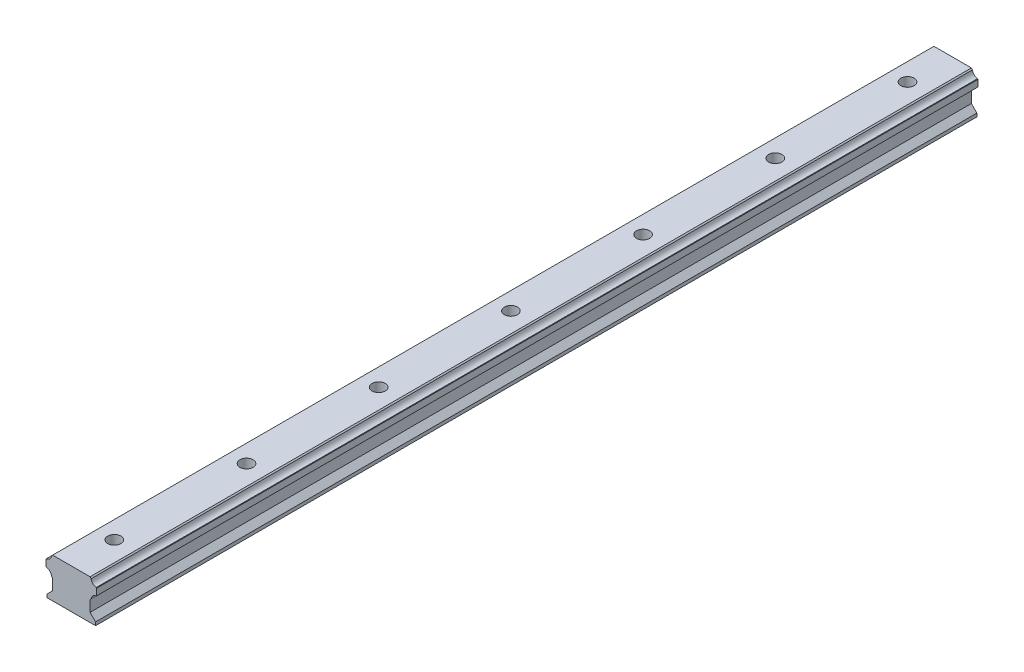
ISO-10303-21;
HEADER;
FILE_DESCRIPTION(('STEP AP214'),'2;1');
FILE_NAME('part.step','',(''),(''),'','','');
FILE_SCHEMA(('AUTOMOTIVE_DESIGN { 1 0 10303 214 1 1 1 1 }'));
ENDSEC;
DATA;
#1=APPLICATION_CONTEXT('core data for automotive mechanical design processes');
#2=APPLICATION_PROTOCOL_DEFINITION('international standard','automotive_design',2000,#1);
#3=PRODUCT_CONTEXT('',#1,'mechanical');
#4=PRODUCT('Part','Part','',(#3));
#5=PRODUCT_RELATED_PRODUCT_CATEGORY('part','',(#4));
#6=PRODUCT_DEFINITION_FORMATION('','',#4);
#7=PRODUCT_DEFINITION_CONTEXT('part definition',#1,'design');
#8=PRODUCT_DEFINITION('design','',#6,#7);
#9=PRODUCT_DEFINITION_SHAPE('','',#8);
#10=(LENGTH_UNIT() NAMED_UNIT(*) SI_UNIT(.MILLI.,.METRE.));
#11=(NAMED_UNIT(*) PLANE_ANGLE_UNIT() SI_UNIT($,.RADIAN.));
#12=(NAMED_UNIT(*) SI_UNIT($,.STERADIAN.) SOLID_ANGLE_UNIT());
#13=UNCERTAINTY_MEASURE_WITH_UNIT(LENGTH_MEASURE(1.E-05),#10,'distance_accuracy_value','');
#14=(GEOMETRIC_REPRESENTATION_CONTEXT(3) GLOBAL_UNCERTAINTY_ASSIGNED_CONTEXT((#13)) GLOBAL_UNIT_ASSIGNED_CONTEXT((#10,
#11,#12)) REPRESENTATION_CONTEXT('',''));
#15=CARTESIAN_POINT('',(0.,0.,0.));
#16=DIRECTION('',(0.,0.,1.));
#17=DIRECTION('',(1.,0.,0.));
#18=AXIS2_PLACEMENT_3D('',#15,#16,#17);
#19=CARTESIAN_POINT('',(-10.0012116020146,-16.2762221715419,400.));
#20=DIRECTION('',(1.,0.,0.));
#21=DIRECTION('',(0.,0.,-1.));
#22=AXIS2_PLACEMENT_3D('',#19,#20,#21);
#23=PLANE('',#22);
#24=DIRECTION('',(0.,-1.,0.));
#25=VECTOR('',#24,1.);
#26=CARTESIAN_POINT('',(-10.0012116020146,-16.2762221715419,0.));
#27=LINE('',#26,#25);
#28=CARTESIAN_POINT('',(-10.0012116020146,-16.2762221715419,0.));
#29=VERTEX_POINT('',#28);
#30=CARTESIAN_POINT('',(-10.0012116020146,-17.7762221715421,0.));
#31=VERTEX_POINT('',#30);
#32=EDGE_CURVE('E214',#29,#31,#27,.T.);
#33=ORIENTED_EDGE('',*,*,#32,.T.);
#34=DIRECTION('',(0.,0.,-1.));
#35=VECTOR('',#34,1.);
#36=CARTESIAN_POINT('',(-10.0012116020146,-17.7762221715421,400.));
#37=LINE('',#36,#35);
#38=CARTESIAN_POINT('',(-10.0012116020146,-17.7762221715421,400.));
#39=VERTEX_POINT('',#38);
#40=EDGE_CURVE('E312',#39,#31,#37,.T.);
#41=ORIENTED_EDGE('',*,*,#40,.F.);
#42=DIRECTION('',(0.,-1.,0.));
#43=VECTOR('',#42,1.);
#44=CARTESIAN_POINT('',(-10.0012116020146,-16.2762221715419,400.));
#45=LINE('',#44,#43);
#46=CARTESIAN_POINT('',(-10.0012116020146,-16.2762221715419,400.));
#47=VERTEX_POINT('',#46);
#48=EDGE_CURVE('E257',#47,#39,#45,.T.);
#49=ORIENTED_EDGE('',*,*,#48,.F.);
#50=DIRECTION('',(0.,0.,-1.));
#51=VECTOR('',#50,1.);
#52=CARTESIAN_POINT('',(-10.0012116020146,-16.2762221715419,400.));
#53=LINE('',#52,#51);
#54=EDGE_CURVE('E210',#47,#29,#53,.T.);
#55=ORIENTED_EDGE('',*,*,#54,.T.);
#56=EDGE_LOOP('',(#33,#41,#49,#55));
#57=FACE_BOUND('',#56,.T.);
#58=ADVANCED_FACE('F32',(#57),#23,.F.);
#59=CARTESIAN_POINT('',(-10.0012116020146,-17.7762221715421,400.));
#60=DIRECTION('',(0.,1.,0.));
#61=DIRECTION('',(0.,0.,1.));
#62=AXIS2_PLACEMENT_3D('',#59,#60,#61);
#63=PLANE('',#62);
#64=CARTESIAN_POINT('',(0.499394198992774,-17.7762221715421,20.0000000000001));
#65=DIRECTION('',(0.,1.,0.));
#66=DIRECTION('',(0.,0.,1.));
#67=AXIS2_PLACEMENT_3D('',#64,#65,#66);
#68=CIRCLE('',#67,3.);
#69=CARTESIAN_POINT('',(0.499394198992774,-17.7762221715421,23.0000000000001));
#70=VERTEX_POINT('',#69);
#71=EDGE_CURVE('E487',#70,#70,#68,.T.);
#72=ORIENTED_EDGE('',*,*,#71,.T.);
#73=EDGE_LOOP('',(#72));
#74=FACE_BOUND('',#73,.T.);
#75=CARTESIAN_POINT('',(0.499394198992774,-17.7762221715421,80.0000000000001));
#76=DIRECTION('',(0.,1.,0.));
#77=DIRECTION('',(0.,0.,1.));
#78=AXIS2_PLACEMENT_3D('',#75,#76,#77);
#79=CIRCLE('',#78,3.);
#80=CARTESIAN_POINT('',(0.499394198992774,-17.7762221715421,83.0000000000001));
#81=VERTEX_POINT('',#80);
#82=EDGE_CURVE('E481',#81,#81,#79,.T.);
#83=ORIENTED_EDGE('',*,*,#82,.T.);
#84=EDGE_LOOP('',(#83));
#85=FACE_BOUND('',#84,.T.);
#86=CARTESIAN_POINT('',(0.499394198992774,-17.7762221715421,140.));
#87=DIRECTION('',(0.,1.,0.));
#88=DIRECTION('',(0.,0.,1.));
#89=AXIS2_PLACEMENT_3D('',#86,#87,#88);
#90=CIRCLE('',#89,3.);
#91=CARTESIAN_POINT('',(0.499394198992774,-17.7762221715421,143.));
#92=VERTEX_POINT('',#91);
#93=EDGE_CURVE('E477',#92,#92,#90,.T.);
#94=ORIENTED_EDGE('',*,*,#93,.T.);
#95=EDGE_LOOP('',(#94));
#96=FACE_BOUND('',#95,.T.);
#97=CARTESIAN_POINT('',(0.499394198992774,-17.7762221715421,260.));
#98=DIRECTION('',(0.,1.,0.));
#99=DIRECTION('',(0.,0.,1.));
#100=AXIS2_PLACEMENT_3D('',#97,#98,#99);
#101=CIRCLE('',#100,3.);
#102=CARTESIAN_POINT('',(0.499394198992774,-17.7762221715421,263.));
#103=VERTEX_POINT('',#102);
#104=EDGE_CURVE('E474',#103,#103,#101,.T.);
#105=ORIENTED_EDGE('',*,*,#104,.T.);
#106=EDGE_LOOP('',(#105));
#107=FACE_BOUND('',#106,.T.);
#108=CARTESIAN_POINT('',(0.499394198992774,-17.7762221715421,200.));
#109=DIRECTION('',(0.,1.,0.));
#110=DIRECTION('',(0.,0.,1.));
#111=AXIS2_PLACEMENT_3D('',#108,#109,#110);
#112=CIRCLE('',#111,3.);
#113=CARTESIAN_POINT('',(0.499394198992774,-17.7762221715421,203.));
#114=VERTEX_POINT('',#113);
#115=EDGE_CURVE('E218',#114,#114,#112,.T.);
#116=ORIENTED_EDGE('',*,*,#115,.T.);
#117=EDGE_LOOP('',(#116));
#118=FACE_BOUND('',#117,.T.);
#119=DIRECTION('',(1.,0.,0.));
#120=VECTOR('',#119,1.);
#121=CARTESIAN_POINT('',(-10.0012116020146,-17.7762221715421,0.));
#122=LINE('',#121,#120);
#123=CARTESIAN_POINT('',(11.9987883979856,-17.7762221715421,0.));
#124=VERTEX_POINT('',#123);
#125=EDGE_CURVE('E217',#31,#124,#122,.T.);
#126=ORIENTED_EDGE('',*,*,#125,.T.);
#127=DIRECTION('',(0.,0.,-1.));
#128=VECTOR('',#127,1.);
#129=CARTESIAN_POINT('',(11.9987883979856,-17.7762221715421,400.));
#130=LINE('',#129,#128);
#131=CARTESIAN_POINT('',(11.9987883979856,-17.7762221715421,400.));
#132=VERTEX_POINT('',#131);
#133=EDGE_CURVE('E309',#132,#124,#130,.T.);
#134=ORIENTED_EDGE('',*,*,#133,.F.);
#135=DIRECTION('',(1.,0.,0.));
#136=VECTOR('',#135,1.);
#137=CARTESIAN_POINT('',(-10.0012116020146,-17.7762221715421,400.));
#138=LINE('',#137,#136);
#139=EDGE_CURVE('E135',#39,#132,#138,.T.);
#140=ORIENTED_EDGE('',*,*,#139,.F.);
#141=ORIENTED_EDGE('',*,*,#40,.T.);
#142=EDGE_LOOP('',(#126,#134,#140,#141));
#143=FACE_BOUND('',#142,.T.);
#144=CARTESIAN_POINT('',(0.499394198992774,-17.7762221715421,320.));
#145=DIRECTION('',(0.,1.,0.));
#146=DIRECTION('',(0.,0.,1.));
#147=AXIS2_PLACEMENT_3D('',#144,#145,#146);
#148=CIRCLE('',#147,3.);
#149=CARTESIAN_POINT('',(0.499394198992774,-17.7762221715421,323.));
#150=VERTEX_POINT('',#149);
#151=EDGE_CURVE('E314',#150,#150,#148,.T.);
#152=ORIENTED_EDGE('',*,*,#151,.T.);
#153=EDGE_LOOP('',(#152));
#154=FACE_BOUND('',#153,.T.);
#155=CARTESIAN_POINT('',(0.499394198992774,-17.7762221715421,380.));
#156=DIRECTION('',(0.,1.,0.));
#157=DIRECTION('',(0.,0.,1.));
#158=AXIS2_PLACEMENT_3D('',#155,#156,#157);
#159=CIRCLE('',#158,3.);
#160=CARTESIAN_POINT('',(0.499394198992774,-17.7762221715421,383.));
#161=VERTEX_POINT('',#160);
#162=EDGE_CURVE('E41',#161,#161,#159,.T.);
#163=ORIENTED_EDGE('',*,*,#162,.T.);
#164=EDGE_LOOP('',(#163));
#165=FACE_BOUND('',#164,.T.);
#166=ADVANCED_FACE('F322',(#74,#85,#96,#107,#118,#143,#154,#165),#63,.F.);
#167=CARTESIAN_POINT('',(11.9987883979856,-17.7762221715421,400.));
#168=DIRECTION('',(-1.,0.,0.));
#169=DIRECTION('',(0.,0.,1.));
#170=AXIS2_PLACEMENT_3D('',#167,#168,#169);
#171=PLANE('',#170);
#172=DIRECTION('',(0.,1.,0.));
#173=VECTOR('',#172,1.);
#174=CARTESIAN_POINT('',(11.9987883979856,-17.7762221715421,0.));
#175=LINE('',#174,#173);
#176=CARTESIAN_POINT('',(11.9987883979856,-16.2762221715418,0.));
#177=VERTEX_POINT('',#176);
#178=EDGE_CURVE('E220',#124,#177,#175,.T.);
#179=ORIENTED_EDGE('',*,*,#178,.T.);
#180=DIRECTION('',(0.,0.,-1.));
#181=VECTOR('',#180,1.);
#182=CARTESIAN_POINT('',(11.9987883979856,-16.2762221715418,400.));
#183=LINE('',#182,#181);
#184=CARTESIAN_POINT('',(11.9987883979856,-16.2762221715418,400.));
#185=VERTEX_POINT('',#184);
#186=EDGE_CURVE('E306',#185,#177,#183,.T.);
#187=ORIENTED_EDGE('',*,*,#186,.F.);
#188=DIRECTION('',(0.,1.,0.));
#189=VECTOR('',#188,1.);
#190=CARTESIAN_POINT('',(11.9987883979856,-17.7762221715421,400.));
#191=LINE('',#190,#189);
#192=EDGE_CURVE('E462',#132,#185,#191,.T.);
#193=ORIENTED_EDGE('',*,*,#192,.F.);
#194=ORIENTED_EDGE('',*,*,#133,.T.);
#195=EDGE_LOOP('',(#179,#187,#193,#194));
#196=FACE_BOUND('',#195,.T.);
#197=ADVANCED_FACE('F354',(#196),#171,.F.);
#198=CARTESIAN_POINT('',(9.49878839798558,-13.7762221715417,400.));
#199=DIRECTION('',(-0.707106781186548,-0.707106781186548,0.));
#200=DIRECTION('',(0.707106781186548,-0.707106781186548,0.));
#201=AXIS2_PLACEMENT_3D('',#198,#199,#200);
#202=PLANE('',#201);
#203=DIRECTION('',(-0.707106781186548,0.707106781186548,0.));
#204=VECTOR('',#203,1.);
#205=CARTESIAN_POINT('',(9.49878839798558,-13.7762221715417,0.));
#206=LINE('',#205,#204);
#207=CARTESIAN_POINT('',(9.49878839798558,-13.7762221715417,0.));
#208=VERTEX_POINT('',#207);
#209=EDGE_CURVE('E222',#177,#208,#206,.T.);
#210=ORIENTED_EDGE('',*,*,#209,.T.);
#211=DIRECTION('',(0.,0.,-1.));
#212=VECTOR('',#211,1.);
#213=CARTESIAN_POINT('',(9.49878839798558,-13.7762221715417,400.));
#214=LINE('',#213,#212);
#215=CARTESIAN_POINT('',(9.49878839798558,-13.7762221715417,400.));
#216=VERTEX_POINT('',#215);
#217=EDGE_CURVE('E303',#216,#208,#214,.T.);
#218=ORIENTED_EDGE('',*,*,#217,.F.);
#219=DIRECTION('',(-0.707106781186548,0.707106781186548,0.));
#220=VECTOR('',#219,1.);
#221=CARTESIAN_POINT('',(9.49878839798558,-13.7762221715417,400.));
#222=LINE('',#221,#220);
#223=EDGE_CURVE('E460',#185,#216,#222,.T.);
#224=ORIENTED_EDGE('',*,*,#223,.F.);
#225=ORIENTED_EDGE('',*,*,#186,.T.);
#226=EDGE_LOOP('',(#210,#218,#224,#225));
#227=FACE_BOUND('',#226,.T.);
#228=ADVANCED_FACE('F566',(#227),#202,.F.);
#229=CARTESIAN_POINT('',(9.49878839798558,-8.77622217154181,400.));
#230=DIRECTION('',(-1.,0.,0.));
#231=DIRECTION('',(0.,0.,1.));
#232=AXIS2_PLACEMENT_3D('',#229,#230,#231);
#233=PLANE('',#232);
#234=DIRECTION('',(0.,1.,0.));
#235=VECTOR('',#234,1.);
#236=CARTESIAN_POINT('',(9.49878839798558,-8.77622217154181,0.));
#237=LINE('',#236,#235);
#238=CARTESIAN_POINT('',(9.49878839798558,-8.77622217154181,0.));
#239=VERTEX_POINT('',#238);
#240=EDGE_CURVE('E224',#208,#239,#237,.T.);
#241=ORIENTED_EDGE('',*,*,#240,.T.);
#242=DIRECTION('',(0.,0.,-1.));
#243=VECTOR('',#242,1.);
#244=CARTESIAN_POINT('',(9.49878839798558,-8.77622217154181,400.));
#245=LINE('',#244,#243);
#246=CARTESIAN_POINT('',(9.49878839798558,-8.77622217154181,400.));
#247=VERTEX_POINT('',#246);
#248=EDGE_CURVE('E300',#247,#239,#245,.T.);
#249=ORIENTED_EDGE('',*,*,#248,.F.);
#250=DIRECTION('',(0.,1.,0.));
#251=VECTOR('',#250,1.);
#252=CARTESIAN_POINT('',(9.49878839798558,-8.77622217154181,400.));
#253=LINE('',#252,#251);
#254=EDGE_CURVE('E458',#216,#247,#253,.T.);
#255=ORIENTED_EDGE('',*,*,#254,.F.);
#256=ORIENTED_EDGE('',*,*,#217,.T.);
#257=EDGE_LOOP('',(#241,#249,#255,#256));
#258=FACE_BOUND('',#257,.T.);
#259=ADVANCED_FACE('F561',(#258),#233,.F.);
#260=CARTESIAN_POINT('',(10.0063729844235,-8.26863758510385,400.));
#261=DIRECTION('',(-0.707106781186548,0.707106781186548,0.));
#262=DIRECTION('',(-0.707106781186548,-0.707106781186548,0.));
#263=AXIS2_PLACEMENT_3D('',#260,#261,#262);
#264=PLANE('',#263);
#265=DIRECTION('',(0.707106781186548,0.707106781186548,0.));
#266=VECTOR('',#265,1.);
#267=CARTESIAN_POINT('',(10.0063729844235,-8.26863758510385,0.));
#268=LINE('',#267,#266);
#269=CARTESIAN_POINT('',(10.0063729844235,-8.26863758510385,0.));
#270=VERTEX_POINT('',#269);
#271=EDGE_CURVE('E226',#239,#270,#268,.T.);
#272=ORIENTED_EDGE('',*,*,#271,.T.);
#273=DIRECTION('',(0.,0.,-1.));
#274=VECTOR('',#273,1.);
#275=CARTESIAN_POINT('',(10.0063729844235,-8.26863758510385,400.));
#276=LINE('',#275,#274);
#277=CARTESIAN_POINT('',(10.0063729844235,-8.26863758510385,400.));
#278=VERTEX_POINT('',#277);
#279=EDGE_CURVE('E297',#278,#270,#276,.T.);
#280=ORIENTED_EDGE('',*,*,#279,.F.);
#281=DIRECTION('',(0.707106781186548,0.707106781186548,0.));
#282=VECTOR('',#281,1.);
#283=CARTESIAN_POINT('',(10.0063729844235,-8.26863758510385,400.));
#284=LINE('',#283,#282);
#285=EDGE_CURVE('E456',#247,#278,#284,.T.);
#286=ORIENTED_EDGE('',*,*,#285,.F.);
#287=ORIENTED_EDGE('',*,*,#248,.T.);
#288=EDGE_LOOP('',(#272,#280,#286,#287));
#289=FACE_BOUND('',#288,.T.);
#290=ADVANCED_FACE('F555',(#289),#264,.F.);
#291=CARTESIAN_POINT('',(12.4987883979856,-8.46322794005069,400.));
#292=DIRECTION('',(0.,0.,-1.));
#293=DIRECTION('',(-1.,0.,0.));
#294=AXIS2_PLACEMENT_3D('',#291,#292,#293);
#295=CYLINDRICAL_SURFACE('',#294,2.5);
#296=CARTESIAN_POINT('',(12.4987883979856,-8.46322794005069,0.));
#297=DIRECTION('',(0.,0.,-1.));
#298=DIRECTION('',(1.,0.,0.));
#299=AXIS2_PLACEMENT_3D('',#296,#297,#298);
#300=CIRCLE('',#299,2.5);
#301=CARTESIAN_POINT('',(12.3041980430387,-5.97081252648865,0.));
#302=VERTEX_POINT('',#301);
#303=EDGE_CURVE('E228',#270,#302,#300,.T.);
#304=ORIENTED_EDGE('',*,*,#303,.T.);
#305=DIRECTION('',(0.,0.,-1.));
#306=VECTOR('',#305,1.);
#307=CARTESIAN_POINT('',(12.3041980430387,-5.97081252648865,400.));
#308=LINE('',#307,#306);
#309=CARTESIAN_POINT('',(12.3041980430387,-5.97081252648865,400.));
#310=VERTEX_POINT('',#309);
#311=EDGE_CURVE('E294',#310,#302,#308,.T.);
#312=ORIENTED_EDGE('',*,*,#311,.F.);
#313=CARTESIAN_POINT('',(12.4987883979856,-8.46322794005069,400.));
#314=DIRECTION('',(0.,0.,-1.));
#315=DIRECTION('',(1.,0.,0.));
#316=AXIS2_PLACEMENT_3D('',#313,#314,#315);
#317=CIRCLE('',#316,2.5);
#318=EDGE_CURVE('E454',#278,#310,#317,.T.);
#319=ORIENTED_EDGE('',*,*,#318,.F.);
#320=ORIENTED_EDGE('',*,*,#279,.T.);
#321=EDGE_LOOP('',(#304,#312,#319,#320));
#322=FACE_BOUND('',#321,.T.);
#323=ADVANCED_FACE('F551',(#322),#295,.F.);
#324=CARTESIAN_POINT('',(12.4987883979856,-5.77622217154175,400.));
#325=DIRECTION('',(-0.707106781186547,0.707106781186547,0.));
#326=DIRECTION('',(-0.707106781186548,-0.707106781186548,0.));
#327=AXIS2_PLACEMENT_3D('',#324,#325,#326);
#328=PLANE('',#327);
#329=DIRECTION('',(0.707106781186547,0.707106781186547,0.));
#330=VECTOR('',#329,1.);
#331=CARTESIAN_POINT('',(12.4987883979856,-5.77622217154175,0.));
#332=LINE('',#331,#330);
#333=CARTESIAN_POINT('',(12.4987883979856,-5.77622217154175,0.));
#334=VERTEX_POINT('',#333);
#335=EDGE_CURVE('E230',#302,#334,#332,.T.);
#336=ORIENTED_EDGE('',*,*,#335,.T.);
#337=DIRECTION('',(0.,0.,-1.));
#338=VECTOR('',#337,1.);
#339=CARTESIAN_POINT('',(12.4987883979856,-5.77622217154175,400.));
#340=LINE('',#339,#338);
#341=CARTESIAN_POINT('',(12.4987883979856,-5.77622217154175,400.));
#342=VERTEX_POINT('',#341);
#343=EDGE_CURVE('E291',#342,#334,#340,.T.);
#344=ORIENTED_EDGE('',*,*,#343,.F.);
#345=DIRECTION('',(0.707106781186547,0.707106781186547,0.));
#346=VECTOR('',#345,1.);
#347=CARTESIAN_POINT('',(12.4987883979856,-5.77622217154175,400.));
#348=LINE('',#347,#346);
#349=EDGE_CURVE('E452',#310,#342,#348,.T.);
#350=ORIENTED_EDGE('',*,*,#349,.F.);
#351=ORIENTED_EDGE('',*,*,#311,.T.);
#352=EDGE_LOOP('',(#336,#344,#350,#351));
#353=FACE_BOUND('',#352,.T.);
#354=ADVANCED_FACE('F546',(#353),#328,.F.);
#355=CARTESIAN_POINT('',(12.4987883979856,-2.77622217154181,400.));
#356=DIRECTION('',(-1.,0.,0.));
#357=DIRECTION('',(0.,0.,1.));
#358=AXIS2_PLACEMENT_3D('',#355,#356,#357);
#359=PLANE('',#358);
#360=DIRECTION('',(0.,1.,0.));
#361=VECTOR('',#360,1.);
#362=CARTESIAN_POINT('',(12.4987883979856,-2.77622217154181,0.));
#363=LINE('',#362,#361);
#364=CARTESIAN_POINT('',(12.4987883979856,-2.77622217154181,0.));
#365=VERTEX_POINT('',#364);
#366=EDGE_CURVE('E232',#334,#365,#363,.T.);
#367=ORIENTED_EDGE('',*,*,#366,.T.);
#368=DIRECTION('',(0.,0.,-1.));
#369=VECTOR('',#368,1.);
#370=CARTESIAN_POINT('',(12.4987883979856,-2.77622217154181,400.));
#371=LINE('',#370,#369);
#372=CARTESIAN_POINT('',(12.4987883979856,-2.77622217154181,400.));
#373=VERTEX_POINT('',#372);
#374=EDGE_CURVE('E288',#373,#365,#371,.T.);
#375=ORIENTED_EDGE('',*,*,#374,.F.);
#376=DIRECTION('',(0.,1.,0.));
#377=VECTOR('',#376,1.);
#378=CARTESIAN_POINT('',(12.4987883979856,-2.77622217154181,400.));
#379=LINE('',#378,#377);
#380=EDGE_CURVE('E450',#342,#373,#379,.T.);
#381=ORIENTED_EDGE('',*,*,#380,.F.);
#382=ORIENTED_EDGE('',*,*,#343,.T.);
#383=EDGE_LOOP('',(#367,#375,#381,#382));
#384=FACE_BOUND('',#383,.T.);
#385=ADVANCED_FACE('F540',(#384),#359,.F.);
#386=CARTESIAN_POINT('',(12.3041980430388,-2.58163181659496,400.));
#387=DIRECTION('',(-0.707106781186547,-0.707106781186547,0.));
#388=DIRECTION('',(0.707106781186548,-0.707106781186548,0.));
#389=AXIS2_PLACEMENT_3D('',#386,#387,#388);
#390=PLANE('',#389);
#391=DIRECTION('',(-0.707106781186547,0.707106781186547,0.));
#392=VECTOR('',#391,1.);
#393=CARTESIAN_POINT('',(12.3041980430388,-2.58163181659496,0.));
#394=LINE('',#393,#392);
#395=CARTESIAN_POINT('',(12.3041980430388,-2.58163181659496,0.));
#396=VERTEX_POINT('',#395);
#397=EDGE_CURVE('E234',#365,#396,#394,.T.);
#398=ORIENTED_EDGE('',*,*,#397,.T.);
#399=DIRECTION('',(0.,0.,-1.));
#400=VECTOR('',#399,1.);
#401=CARTESIAN_POINT('',(12.3041980430388,-2.58163181659496,400.));
#402=LINE('',#401,#400);
#403=CARTESIAN_POINT('',(12.3041980430388,-2.58163181659496,400.));
#404=VERTEX_POINT('',#403);
#405=EDGE_CURVE('E285',#404,#396,#402,.T.);
#406=ORIENTED_EDGE('',*,*,#405,.F.);
#407=DIRECTION('',(-0.707106781186547,0.707106781186547,0.));
#408=VECTOR('',#407,1.);
#409=CARTESIAN_POINT('',(12.3041980430388,-2.58163181659496,400.));
#410=LINE('',#409,#408);
#411=EDGE_CURVE('E448',#373,#404,#410,.T.);
#412=ORIENTED_EDGE('',*,*,#411,.F.);
#413=ORIENTED_EDGE('',*,*,#374,.T.);
#414=EDGE_LOOP('',(#398,#406,#412,#413));
#415=FACE_BOUND('',#414,.T.);
#416=ADVANCED_FACE('F536',(#415),#390,.F.);
#417=CARTESIAN_POINT('',(12.4987883979856,-0.0892164030329295,400.));
#418=DIRECTION('',(0.,0.,-1.));
#419=DIRECTION('',(-1.,0.,0.));
#420=AXIS2_PLACEMENT_3D('',#417,#418,#419);
#421=CYLINDRICAL_SURFACE('',#420,2.49999999999998);
#422=CARTESIAN_POINT('',(12.4987883979856,-0.0892164030329295,0.));
#423=DIRECTION('',(0.,0.,-1.));
#424=DIRECTION('',(1.,0.,0.));
#425=AXIS2_PLACEMENT_3D('',#422,#423,#424);
#426=CIRCLE('',#425,2.49999999999998);
#427=CARTESIAN_POINT('',(10.0063729844236,-0.283806757979913,0.));
#428=VERTEX_POINT('',#427);
#429=EDGE_CURVE('E236',#396,#428,#426,.T.);
#430=ORIENTED_EDGE('',*,*,#429,.T.);
#431=DIRECTION('',(0.,0.,-1.));
#432=VECTOR('',#431,1.);
#433=CARTESIAN_POINT('',(10.0063729844236,-0.283806757979913,400.));
#434=LINE('',#433,#432);
#435=CARTESIAN_POINT('',(10.0063729844236,-0.283806757979913,400.));
#436=VERTEX_POINT('',#435);
#437=EDGE_CURVE('E282',#436,#428,#434,.T.);
#438=ORIENTED_EDGE('',*,*,#437,.F.);
#439=CARTESIAN_POINT('',(12.4987883979856,-0.0892164030329295,400.));
#440=DIRECTION('',(0.,0.,-1.));
#441=DIRECTION('',(1.,0.,0.));
#442=AXIS2_PLACEMENT_3D('',#439,#440,#441);
#443=CIRCLE('',#442,2.49999999999998);
#444=EDGE_CURVE('E446',#404,#436,#443,.T.);
#445=ORIENTED_EDGE('',*,*,#444,.F.);
#446=ORIENTED_EDGE('',*,*,#405,.T.);
#447=EDGE_LOOP('',(#430,#438,#445,#446));
#448=FACE_BOUND('',#447,.T.);
#449=ADVANCED_FACE('F343',(#448),#421,.F.);
#450=CARTESIAN_POINT('',(9.49878839798586,0.223777828457852,400.));
#451=DIRECTION('',(-0.707106781186548,-0.707106781186548,0.));
#452=DIRECTION('',(0.707106781186548,-0.707106781186548,0.));
#453=AXIS2_PLACEMENT_3D('',#450,#451,#452);
#454=PLANE('',#453);
#455=DIRECTION('',(-0.707106781186548,0.707106781186548,0.));
#456=VECTOR('',#455,1.);
#457=CARTESIAN_POINT('',(9.49878839798586,0.223777828457852,0.));
#458=LINE('',#457,#456);
#459=CARTESIAN_POINT('',(9.49878839798586,0.223777828457852,0.));
#460=VERTEX_POINT('',#459);
#461=EDGE_CURVE('E238',#428,#460,#458,.T.);
#462=ORIENTED_EDGE('',*,*,#461,.T.);
#463=DIRECTION('',(0.,0.,-1.));
#464=VECTOR('',#463,1.);
#465=CARTESIAN_POINT('',(9.49878839798586,0.223777828457852,400.));
#466=LINE('',#465,#464);
#467=CARTESIAN_POINT('',(9.49878839798586,0.223777828457852,400.));
#468=VERTEX_POINT('',#467);
#469=EDGE_CURVE('E279',#468,#460,#466,.T.);
#470=ORIENTED_EDGE('',*,*,#469,.F.);
#471=DIRECTION('',(-0.707106781186548,0.707106781186548,0.));
#472=VECTOR('',#471,1.);
#473=CARTESIAN_POINT('',(9.49878839798586,0.223777828457852,400.));
#474=LINE('',#473,#472);
#475=EDGE_CURVE('E444',#436,#468,#474,.T.);
#476=ORIENTED_EDGE('',*,*,#475,.F.);
#477=ORIENTED_EDGE('',*,*,#437,.T.);
#478=EDGE_LOOP('',(#462,#470,#476,#477));
#479=FACE_BOUND('',#478,.T.);
#480=ADVANCED_FACE('F333',(#479),#454,.F.);
#481=CARTESIAN_POINT('',(-7.50121160201476,0.223777828457852,400.));
#482=DIRECTION('',(0.,-1.,0.));
#483=DIRECTION('',(0.,0.,-1.));
#484=AXIS2_PLACEMENT_3D('',#481,#482,#483);
#485=PLANE('',#484);
#486=CARTESIAN_POINT('',(0.499394198992774,0.223777828457852,20.0000000000001));
#487=DIRECTION('',(0.,1.,0.));
#488=DIRECTION('',(0.,0.,1.));
#489=AXIS2_PLACEMENT_3D('',#486,#487,#488);
#490=CIRCLE('',#489,3.);
#491=CARTESIAN_POINT('',(0.499394198992774,0.223777828457852,23.0000000000001));
#492=VERTEX_POINT('',#491);
#493=EDGE_CURVE('E490',#492,#492,#490,.T.);
#494=ORIENTED_EDGE('',*,*,#493,.F.);
#495=EDGE_LOOP('',(#494));
#496=FACE_BOUND('',#495,.T.);
#497=CARTESIAN_POINT('',(0.499394198992774,0.223777828457852,80.0000000000001));
#498=DIRECTION('',(0.,1.,0.));
#499=DIRECTION('',(0.,0.,1.));
#500=AXIS2_PLACEMENT_3D('',#497,#498,#499);
#501=CIRCLE('',#500,3.);
#502=CARTESIAN_POINT('',(0.499394198992774,0.223777828457852,83.0000000000001));
#503=VERTEX_POINT('',#502);
#504=EDGE_CURVE('E484',#503,#503,#501,.T.);
#505=ORIENTED_EDGE('',*,*,#504,.F.);
#506=EDGE_LOOP('',(#505));
#507=FACE_BOUND('',#506,.T.);
#508=CARTESIAN_POINT('',(0.499394198992774,0.223777828457852,140.));
#509=DIRECTION('',(0.,1.,0.));
#510=DIRECTION('',(0.,0.,1.));
#511=AXIS2_PLACEMENT_3D('',#508,#509,#510);
#512=CIRCLE('',#511,3.);
#513=CARTESIAN_POINT('',(0.499394198992774,0.223777828457852,143.));
#514=VERTEX_POINT('',#513);
#515=EDGE_CURVE('E478',#514,#514,#512,.T.);
#516=ORIENTED_EDGE('',*,*,#515,.F.);
#517=EDGE_LOOP('',(#516));
#518=FACE_BOUND('',#517,.T.);
#519=CARTESIAN_POINT('',(0.499394198992774,0.223777828457852,260.));
#520=DIRECTION('',(0.,1.,0.));
#521=DIRECTION('',(0.,0.,1.));
#522=AXIS2_PLACEMENT_3D('',#519,#520,#521);
#523=CIRCLE('',#522,3.);
#524=CARTESIAN_POINT('',(0.499394198992774,0.223777828457852,263.));
#525=VERTEX_POINT('',#524);
#526=EDGE_CURVE('E469',#525,#525,#523,.T.);
#527=ORIENTED_EDGE('',*,*,#526,.F.);
#528=EDGE_LOOP('',(#527));
#529=FACE_BOUND('',#528,.T.);
#530=CARTESIAN_POINT('',(0.499394198992774,0.223777828457852,200.));
#531=DIRECTION('',(0.,1.,0.));
#532=DIRECTION('',(0.,0.,1.));
#533=AXIS2_PLACEMENT_3D('',#530,#531,#532);
#534=CIRCLE('',#533,3.);
#535=CARTESIAN_POINT('',(0.499394198992774,0.223777828457852,203.));
#536=VERTEX_POINT('',#535);
#537=EDGE_CURVE('E466',#536,#536,#534,.T.);
#538=ORIENTED_EDGE('',*,*,#537,.F.);
#539=EDGE_LOOP('',(#538));
#540=FACE_BOUND('',#539,.T.);
#541=DIRECTION('',(-1.,0.,0.));
#542=VECTOR('',#541,1.);
#543=CARTESIAN_POINT('',(-7.50121160201476,0.223777828457852,0.));
#544=LINE('',#543,#542);
#545=CARTESIAN_POINT('',(-7.50121160201476,0.223777828457852,0.));
#546=VERTEX_POINT('',#545);
#547=EDGE_CURVE('E240',#460,#546,#544,.T.);
#548=ORIENTED_EDGE('',*,*,#547,.T.);
#549=DIRECTION('',(0.,0.,-1.));
#550=VECTOR('',#549,1.);
#551=CARTESIAN_POINT('',(-7.50121160201476,0.223777828457852,400.));
#552=LINE('',#551,#550);
#553=CARTESIAN_POINT('',(-7.50121160201476,0.223777828457852,400.));
#554=VERTEX_POINT('',#553);
#555=EDGE_CURVE('E276',#554,#546,#552,.T.);
#556=ORIENTED_EDGE('',*,*,#555,.F.);
#557=DIRECTION('',(-1.,0.,0.));
#558=VECTOR('',#557,1.);
#559=CARTESIAN_POINT('',(-7.50121160201476,0.223777828457852,400.));
#560=LINE('',#559,#558);
#561=EDGE_CURVE('E442',#468,#554,#560,.T.);
#562=ORIENTED_EDGE('',*,*,#561,.F.);
#563=ORIENTED_EDGE('',*,*,#469,.T.);
#564=EDGE_LOOP('',(#548,#556,#562,#563));
#565=FACE_BOUND('',#564,.T.);
#566=CARTESIAN_POINT('',(0.499394198992774,0.223777828457852,320.));
#567=DIRECTION('',(0.,1.,0.));
#568=DIRECTION('',(0.,0.,1.));
#569=AXIS2_PLACEMENT_3D('',#566,#567,#568);
#570=CIRCLE('',#569,3.);
#571=CARTESIAN_POINT('',(0.499394198992774,0.223777828457852,323.));
#572=VERTEX_POINT('',#571);
#573=EDGE_CURVE('E317',#572,#572,#570,.T.);
#574=ORIENTED_EDGE('',*,*,#573,.F.);
#575=EDGE_LOOP('',(#574));
#576=FACE_BOUND('',#575,.T.);
#577=CARTESIAN_POINT('',(0.499394198992774,0.223777828457852,380.));
#578=DIRECTION('',(0.,1.,0.));
#579=DIRECTION('',(0.,0.,1.));
#580=AXIS2_PLACEMENT_3D('',#577,#578,#579);
#581=CIRCLE('',#580,3.);
#582=CARTESIAN_POINT('',(0.499394198992774,0.223777828457852,383.));
#583=VERTEX_POINT('',#582);
#584=EDGE_CURVE('E11',#583,#583,#581,.T.);
#585=ORIENTED_EDGE('',*,*,#584,.F.);
#586=EDGE_LOOP('',(#585));
#587=FACE_BOUND('',#586,.T.);
#588=ADVANCED_FACE('F330',(#496,#507,#518,#529,#540,#565,#576,#587),#485,.F.);
#589=CARTESIAN_POINT('',(-8.0087961884529,-0.283806757980287,400.));
#590=DIRECTION('',(0.707106781186549,-0.707106781186546,0.));
#591=DIRECTION('',(0.707106781186546,0.707106781186549,0.));
#592=AXIS2_PLACEMENT_3D('',#589,#590,#591);
#593=PLANE('',#592);
#594=DIRECTION('',(-0.707106781186546,-0.707106781186549,0.));
#595=VECTOR('',#594,1.);
#596=CARTESIAN_POINT('',(-8.0087961884529,-0.283806757980287,0.));
#597=LINE('',#596,#595);
#598=CARTESIAN_POINT('',(-8.00879618845291,-0.283806757980287,0.));
#599=VERTEX_POINT('',#598);
#600=EDGE_CURVE('E242',#546,#599,#597,.T.);
#601=ORIENTED_EDGE('',*,*,#600,.T.);
#602=DIRECTION('',(0.,0.,-1.));
#603=VECTOR('',#602,1.);
#604=CARTESIAN_POINT('',(-8.00879618845291,-0.283806757980287,400.));
#605=LINE('',#604,#603);
#606=CARTESIAN_POINT('',(-8.00879618845291,-0.283806757980287,400.));
#607=VERTEX_POINT('',#606);
#608=EDGE_CURVE('E273',#607,#599,#605,.T.);
#609=ORIENTED_EDGE('',*,*,#608,.F.);
#610=DIRECTION('',(-0.707106781186546,-0.707106781186549,0.));
#611=VECTOR('',#610,1.);
#612=CARTESIAN_POINT('',(-8.0087961884529,-0.283806757980287,400.));
#613=LINE('',#612,#611);
#614=EDGE_CURVE('E440',#554,#607,#613,.T.);
#615=ORIENTED_EDGE('',*,*,#614,.F.);
#616=ORIENTED_EDGE('',*,*,#555,.T.);
#617=EDGE_LOOP('',(#601,#609,#615,#616));
#618=FACE_BOUND('',#617,.T.);
#619=ADVANCED_FACE('F332',(#618),#593,.F.);
#620=CARTESIAN_POINT('',(-10.5012116020148,-0.0892164030332557,400.));
#621=DIRECTION('',(0.,0.,-1.));
#622=DIRECTION('',(-1.,0.,0.));
#623=AXIS2_PLACEMENT_3D('',#620,#621,#622);
#624=CYLINDRICAL_SURFACE('',#623,2.49999999999983);
#625=CARTESIAN_POINT('',(-10.5012116020148,-0.0892164030332557,0.));
#626=DIRECTION('',(0.,0.,-1.));
#627=DIRECTION('',(1.,0.,0.));
#628=AXIS2_PLACEMENT_3D('',#625,#626,#627);
#629=CIRCLE('',#628,2.49999999999983);
#630=CARTESIAN_POINT('',(-10.3066212470681,-2.58163181659515,0.));
#631=VERTEX_POINT('',#630);
#632=EDGE_CURVE('E244',#599,#631,#629,.T.);
#633=ORIENTED_EDGE('',*,*,#632,.T.);
#634=DIRECTION('',(0.,0.,-1.));
#635=VECTOR('',#634,1.);
#636=CARTESIAN_POINT('',(-10.3066212470681,-2.58163181659515,400.));
#637=LINE('',#636,#635);
#638=CARTESIAN_POINT('',(-10.3066212470681,-2.58163181659515,400.));
#639=VERTEX_POINT('',#638);
#640=EDGE_CURVE('E270',#639,#631,#637,.T.);
#641=ORIENTED_EDGE('',*,*,#640,.F.);
#642=CARTESIAN_POINT('',(-10.5012116020148,-0.0892164030332557,400.));
#643=DIRECTION('',(0.,0.,-1.));
#644=DIRECTION('',(1.,0.,0.));
#645=AXIS2_PLACEMENT_3D('',#642,#643,#644);
#646=CIRCLE('',#645,2.49999999999983);
#647=EDGE_CURVE('E438',#607,#639,#646,.T.);
#648=ORIENTED_EDGE('',*,*,#647,.F.);
#649=ORIENTED_EDGE('',*,*,#608,.T.);
#650=EDGE_LOOP('',(#633,#641,#648,#649));
#651=FACE_BOUND('',#650,.T.);
#652=ADVANCED_FACE('F340',(#651),#624,.F.);
#653=CARTESIAN_POINT('',(-10.5012116020148,-2.77622217154183,400.));
#654=DIRECTION('',(0.707106781186548,-0.707106781186548,0.));
#655=DIRECTION('',(0.707106781186548,0.707106781186548,0.));
#656=AXIS2_PLACEMENT_3D('',#653,#654,#655);
#657=PLANE('',#656);
#658=DIRECTION('',(-0.707106781186548,-0.707106781186548,0.));
#659=VECTOR('',#658,1.);
#660=CARTESIAN_POINT('',(-10.5012116020148,-2.77622217154183,0.));
#661=LINE('',#660,#659);
#662=CARTESIAN_POINT('',(-10.5012116020148,-2.77622217154183,0.));
#663=VERTEX_POINT('',#662);
#664=EDGE_CURVE('E246',#631,#663,#661,.T.);
#665=ORIENTED_EDGE('',*,*,#664,.T.);
#666=DIRECTION('',(0.,0.,-1.));
#667=VECTOR('',#666,1.);
#668=CARTESIAN_POINT('',(-10.5012116020148,-2.77622217154183,400.));
#669=LINE('',#668,#667);
#670=CARTESIAN_POINT('',(-10.5012116020148,-2.77622217154183,400.));
#671=VERTEX_POINT('',#670);
#672=EDGE_CURVE('E267',#671,#663,#669,.T.);
#673=ORIENTED_EDGE('',*,*,#672,.F.);
#674=DIRECTION('',(-0.707106781186548,-0.707106781186548,0.));
#675=VECTOR('',#674,1.);
#676=CARTESIAN_POINT('',(-10.5012116020148,-2.77622217154183,400.));
#677=LINE('',#676,#675);
#678=EDGE_CURVE('E423',#639,#671,#677,.T.);
#679=ORIENTED_EDGE('',*,*,#678,.F.);
#680=ORIENTED_EDGE('',*,*,#640,.T.);
#681=EDGE_LOOP('',(#665,#673,#679,#680));
#682=FACE_BOUND('',#681,.T.);
#683=ADVANCED_FACE('F406',(#682),#657,.F.);
#684=CARTESIAN_POINT('',(-10.5012116020148,-5.77622217154183,400.));
#685=DIRECTION('',(1.,0.,0.));
#686=DIRECTION('',(0.,0.,-1.));
#687=AXIS2_PLACEMENT_3D('',#684,#685,#686);
#688=PLANE('',#687);
#689=DIRECTION('',(0.,-1.,0.));
#690=VECTOR('',#689,1.);
#691=CARTESIAN_POINT('',(-10.5012116020148,-5.77622217154183,0.));
#692=LINE('',#691,#690);
#693=CARTESIAN_POINT('',(-10.5012116020148,-5.77622217154183,0.));
#694=VERTEX_POINT('',#693);
#695=EDGE_CURVE('E248',#663,#694,#692,.T.);
#696=ORIENTED_EDGE('',*,*,#695,.T.);
#697=DIRECTION('',(0.,0.,-1.));
#698=VECTOR('',#697,1.);
#699=CARTESIAN_POINT('',(-10.5012116020148,-5.77622217154183,400.));
#700=LINE('',#699,#698);
#701=CARTESIAN_POINT('',(-10.5012116020148,-5.77622217154183,400.));
#702=VERTEX_POINT('',#701);
#703=EDGE_CURVE('E264',#702,#694,#700,.T.);
#704=ORIENTED_EDGE('',*,*,#703,.F.);
#705=DIRECTION('',(0.,-1.,0.));
#706=VECTOR('',#705,1.);
#707=CARTESIAN_POINT('',(-10.5012116020148,-5.77622217154183,400.));
#708=LINE('',#707,#706);
#709=EDGE_CURVE('E433',#671,#702,#708,.T.);
#710=ORIENTED_EDGE('',*,*,#709,.F.);
#711=ORIENTED_EDGE('',*,*,#672,.T.);
#712=EDGE_LOOP('',(#696,#704,#710,#711));
#713=FACE_BOUND('',#712,.T.);
#714=ADVANCED_FACE('F402',(#713),#688,.F.);
#715=CARTESIAN_POINT('',(-10.3066212470679,-5.97081252648868,400.));
#716=DIRECTION('',(0.707106781186548,0.707106781186548,0.));
#717=DIRECTION('',(-0.707106781186548,0.707106781186548,0.));
#718=AXIS2_PLACEMENT_3D('',#715,#716,#717);
#719=PLANE('',#718);
#720=DIRECTION('',(0.707106781186548,-0.707106781186548,0.));
#721=VECTOR('',#720,1.);
#722=CARTESIAN_POINT('',(-10.3066212470679,-5.97081252648868,0.));
#723=LINE('',#722,#721);
#724=CARTESIAN_POINT('',(-10.3066212470679,-5.97081252648868,0.));
#725=VERTEX_POINT('',#724);
#726=EDGE_CURVE('E250',#694,#725,#723,.T.);
#727=ORIENTED_EDGE('',*,*,#726,.T.);
#728=DIRECTION('',(0.,0.,-1.));
#729=VECTOR('',#728,1.);
#730=CARTESIAN_POINT('',(-10.3066212470679,-5.97081252648868,400.));
#731=LINE('',#730,#729);
#732=CARTESIAN_POINT('',(-10.3066212470679,-5.97081252648868,400.));
#733=VERTEX_POINT('',#732);
#734=EDGE_CURVE('E261',#733,#725,#731,.T.);
#735=ORIENTED_EDGE('',*,*,#734,.F.);
#736=DIRECTION('',(0.707106781186548,-0.707106781186548,0.));
#737=VECTOR('',#736,1.);
#738=CARTESIAN_POINT('',(-10.3066212470679,-5.97081252648868,400.));
#739=LINE('',#738,#737);
#740=EDGE_CURVE('E432',#702,#733,#739,.T.);
#741=ORIENTED_EDGE('',*,*,#740,.F.);
#742=ORIENTED_EDGE('',*,*,#703,.T.);
#743=EDGE_LOOP('',(#727,#735,#741,#742));
#744=FACE_BOUND('',#743,.T.);
#745=ADVANCED_FACE('F398',(#744),#719,.F.);
#746=CARTESIAN_POINT('',(-10.5012116020148,-8.46322794005072,400.));
#747=DIRECTION('',(0.,0.,-1.));
#748=DIRECTION('',(-1.,0.,0.));
#749=AXIS2_PLACEMENT_3D('',#746,#747,#748);
#750=CYLINDRICAL_SURFACE('',#749,2.5);
#751=CARTESIAN_POINT('',(-10.5012116020148,-8.46322794005072,0.));
#752=DIRECTION('',(0.,0.,-1.));
#753=DIRECTION('',(1.,0.,0.));
#754=AXIS2_PLACEMENT_3D('',#751,#752,#753);
#755=CIRCLE('',#754,2.5);
#756=CARTESIAN_POINT('',(-8.00879618845272,-8.26863758510388,0.));
#757=VERTEX_POINT('',#756);
#758=EDGE_CURVE('E252',#725,#757,#755,.T.);
#759=ORIENTED_EDGE('',*,*,#758,.T.);
#760=DIRECTION('',(0.,0.,-1.));
#761=VECTOR('',#760,1.);
#762=CARTESIAN_POINT('',(-8.00879618845272,-8.26863758510388,400.));
#763=LINE('',#762,#761);
#764=CARTESIAN_POINT('',(-8.00879618845272,-8.26863758510388,400.));
#765=VERTEX_POINT('',#764);
#766=EDGE_CURVE('E205',#765,#757,#763,.T.);
#767=ORIENTED_EDGE('',*,*,#766,.F.);
#768=CARTESIAN_POINT('',(-10.5012116020148,-8.46322794005072,400.));
#769=DIRECTION('',(0.,0.,-1.));
#770=DIRECTION('',(1.,0.,0.));
#771=AXIS2_PLACEMENT_3D('',#768,#769,#770);
#772=CIRCLE('',#771,2.5);
#773=EDGE_CURVE('E196',#733,#765,#772,.T.);
#774=ORIENTED_EDGE('',*,*,#773,.F.);
#775=ORIENTED_EDGE('',*,*,#734,.T.);
#776=EDGE_LOOP('',(#759,#767,#774,#775));
#777=FACE_BOUND('',#776,.T.);
#778=ADVANCED_FACE('F395',(#777),#750,.F.);
#779=CARTESIAN_POINT('',(-7.50121160201465,-8.77622217154195,400.));
#780=DIRECTION('',(0.707106781186548,0.707106781186548,0.));
#781=DIRECTION('',(-0.707106781186548,0.707106781186548,0.));
#782=AXIS2_PLACEMENT_3D('',#779,#780,#781);
#783=PLANE('',#782);
#784=DIRECTION('',(0.707106781186548,-0.707106781186548,0.));
#785=VECTOR('',#784,1.);
#786=CARTESIAN_POINT('',(-7.50121160201465,-8.77622217154195,0.));
#787=LINE('',#786,#785);
#788=CARTESIAN_POINT('',(-7.50121160201465,-8.77622217154195,0.));
#789=VERTEX_POINT('',#788);
#790=EDGE_CURVE('E204',#757,#789,#787,.T.);
#791=ORIENTED_EDGE('',*,*,#790,.T.);
#792=DIRECTION('',(0.,0.,-1.));
#793=VECTOR('',#792,1.);
#794=CARTESIAN_POINT('',(-7.50121160201465,-8.77622217154195,400.));
#795=LINE('',#794,#793);
#796=CARTESIAN_POINT('',(-7.50121160201465,-8.77622217154195,400.));
#797=VERTEX_POINT('',#796);
#798=EDGE_CURVE('E201',#797,#789,#795,.T.);
#799=ORIENTED_EDGE('',*,*,#798,.F.);
#800=DIRECTION('',(0.707106781186548,-0.707106781186548,0.));
#801=VECTOR('',#800,1.);
#802=CARTESIAN_POINT('',(-7.50121160201465,-8.77622217154195,400.));
#803=LINE('',#802,#801);
#804=EDGE_CURVE('E190',#765,#797,#803,.T.);
#805=ORIENTED_EDGE('',*,*,#804,.F.);
#806=ORIENTED_EDGE('',*,*,#766,.T.);
#807=EDGE_LOOP('',(#791,#799,#805,#806));
#808=FACE_BOUND('',#807,.T.);
#809=ADVANCED_FACE('F202',(#808),#783,.F.);
#810=CARTESIAN_POINT('',(-7.50121160201465,-13.7762221715419,400.));
#811=DIRECTION('',(1.,0.,0.));
#812=DIRECTION('',(0.,0.,-1.));
#813=AXIS2_PLACEMENT_3D('',#810,#811,#812);
#814=PLANE('',#813);
#815=DIRECTION('',(0.,-1.,0.));
#816=VECTOR('',#815,1.);
#817=CARTESIAN_POINT('',(-7.50121160201465,-13.7762221715419,0.));
#818=LINE('',#817,#816);
#819=CARTESIAN_POINT('',(-7.50121160201465,-13.7762221715419,0.));
#820=VERTEX_POINT('',#819);
#821=EDGE_CURVE('E120',#789,#820,#818,.T.);
#822=ORIENTED_EDGE('',*,*,#821,.T.);
#823=DIRECTION('',(0.,0.,-1.));
#824=VECTOR('',#823,1.);
#825=CARTESIAN_POINT('',(-7.50121160201465,-13.7762221715419,400.));
#826=LINE('',#825,#824);
#827=CARTESIAN_POINT('',(-7.50121160201465,-13.7762221715419,400.));
#828=VERTEX_POINT('',#827);
#829=EDGE_CURVE('E206',#828,#820,#826,.T.);
#830=ORIENTED_EDGE('',*,*,#829,.F.);
#831=DIRECTION('',(0.,-1.,0.));
#832=VECTOR('',#831,1.);
#833=CARTESIAN_POINT('',(-7.50121160201465,-13.7762221715419,400.));
#834=LINE('',#833,#832);
#835=EDGE_CURVE('E194',#797,#828,#834,.T.);
#836=ORIENTED_EDGE('',*,*,#835,.F.);
#837=ORIENTED_EDGE('',*,*,#798,.T.);
#838=EDGE_LOOP('',(#822,#830,#836,#837));
#839=FACE_BOUND('',#838,.T.);
#840=ADVANCED_FACE('F208',(#839),#814,.F.);
#841=CARTESIAN_POINT('',(-10.0012116020146,-16.2762221715419,400.));
#842=DIRECTION('',(0.707106781186547,-0.707106781186548,0.));
#843=DIRECTION('',(0.707106781186548,0.707106781186547,0.));
#844=AXIS2_PLACEMENT_3D('',#841,#842,#843);
#845=PLANE('',#844);
#846=DIRECTION('',(-0.707106781186548,-0.707106781186547,0.));
#847=VECTOR('',#846,1.);
#848=CARTESIAN_POINT('',(-10.0012116020146,-16.2762221715419,0.));
#849=LINE('',#848,#847);
#850=EDGE_CURVE('E126',#820,#29,#849,.T.);
#851=ORIENTED_EDGE('',*,*,#850,.T.);
#852=ORIENTED_EDGE('',*,*,#54,.F.);
#853=DIRECTION('',(-0.707106781186548,-0.707106781186547,0.));
#854=VECTOR('',#853,1.);
#855=CARTESIAN_POINT('',(-10.0012116020146,-16.2762221715419,400.));
#856=LINE('',#855,#854);
#857=EDGE_CURVE('E49',#828,#47,#856,.T.);
#858=ORIENTED_EDGE('',*,*,#857,.F.);
#859=ORIENTED_EDGE('',*,*,#829,.T.);
#860=EDGE_LOOP('',(#851,#852,#858,#859));
#861=FACE_BOUND('',#860,.T.);
#862=ADVANCED_FACE('F385',(#861),#845,.F.);
#863=CARTESIAN_POINT('',(12.4987883979856,-8.46322794005069,400.));
#864=DIRECTION('',(0.,0.,1.));
#865=DIRECTION('',(1.,0.,0.));
#866=AXIS2_PLACEMENT_3D('',#863,#864,#865);
#867=PLANE('',#866);
#868=ORIENTED_EDGE('',*,*,#48,.T.);
#869=ORIENTED_EDGE('',*,*,#139,.T.);
#870=ORIENTED_EDGE('',*,*,#192,.T.);
#871=ORIENTED_EDGE('',*,*,#223,.T.);
#872=ORIENTED_EDGE('',*,*,#254,.T.);
#873=ORIENTED_EDGE('',*,*,#285,.T.);
#874=ORIENTED_EDGE('',*,*,#318,.T.);
#875=ORIENTED_EDGE('',*,*,#349,.T.);
#876=ORIENTED_EDGE('',*,*,#380,.T.);
#877=ORIENTED_EDGE('',*,*,#411,.T.);
#878=ORIENTED_EDGE('',*,*,#444,.T.);
#879=ORIENTED_EDGE('',*,*,#475,.T.);
#880=ORIENTED_EDGE('',*,*,#561,.T.);
#881=ORIENTED_EDGE('',*,*,#614,.T.);
#882=ORIENTED_EDGE('',*,*,#647,.T.);
#883=ORIENTED_EDGE('',*,*,#678,.T.);
#884=ORIENTED_EDGE('',*,*,#709,.T.);
#885=ORIENTED_EDGE('',*,*,#740,.T.);
#886=ORIENTED_EDGE('',*,*,#773,.T.);
#887=ORIENTED_EDGE('',*,*,#804,.T.);
#888=ORIENTED_EDGE('',*,*,#835,.T.);
#889=ORIENTED_EDGE('',*,*,#857,.T.);
#890=EDGE_LOOP('',(#868,#869,#870,#871,#872,#873,#874,#875,#876,#877,#878,#879,#880,#881,#882,
#883,#884,#885,#886,#887,#888,#889));
#891=FACE_BOUND('',#890,.T.);
#892=ADVANCED_FACE('F192',(#891),#867,.T.);
#893=CARTESIAN_POINT('',(12.4987883979856,-8.46322794005069,0.));
#894=DIRECTION('',(0.,0.,1.));
#895=DIRECTION('',(1.,0.,0.));
#896=AXIS2_PLACEMENT_3D('',#893,#894,#895);
#897=PLANE('',#896);
#898=ORIENTED_EDGE('',*,*,#32,.F.);
#899=ORIENTED_EDGE('',*,*,#850,.F.);
#900=ORIENTED_EDGE('',*,*,#821,.F.);
#901=ORIENTED_EDGE('',*,*,#790,.F.);
#902=ORIENTED_EDGE('',*,*,#758,.F.);
#903=ORIENTED_EDGE('',*,*,#726,.F.);
#904=ORIENTED_EDGE('',*,*,#695,.F.);
#905=ORIENTED_EDGE('',*,*,#664,.F.);
#906=ORIENTED_EDGE('',*,*,#632,.F.);
#907=ORIENTED_EDGE('',*,*,#600,.F.);
#908=ORIENTED_EDGE('',*,*,#547,.F.);
#909=ORIENTED_EDGE('',*,*,#461,.F.);
#910=ORIENTED_EDGE('',*,*,#429,.F.);
#911=ORIENTED_EDGE('',*,*,#397,.F.);
#912=ORIENTED_EDGE('',*,*,#366,.F.);
#913=ORIENTED_EDGE('',*,*,#335,.F.);
#914=ORIENTED_EDGE('',*,*,#303,.F.);
#915=ORIENTED_EDGE('',*,*,#271,.F.);
#916=ORIENTED_EDGE('',*,*,#240,.F.);
#917=ORIENTED_EDGE('',*,*,#209,.F.);
#918=ORIENTED_EDGE('',*,*,#178,.F.);
#919=ORIENTED_EDGE('',*,*,#125,.F.);
#920=EDGE_LOOP('',(#898,#899,#900,#901,#902,#903,#904,#905,#906,#907,#908,#909,#910,#911,#912,
#913,#914,#915,#916,#917,#918,#919));
#921=FACE_BOUND('',#920,.T.);
#922=ADVANCED_FACE('F375',(#921),#897,.F.);
#923=CARTESIAN_POINT('',(0.499394198992774,-17.7762221715421,200.));
#924=DIRECTION('',(0.,1.,0.));
#925=DIRECTION('',(0.,0.,1.));
#926=AXIS2_PLACEMENT_3D('',#923,#924,#925);
#927=CYLINDRICAL_SURFACE('',#926,3.);
#928=ORIENTED_EDGE('',*,*,#115,.F.);
#929=EDGE_LOOP('',(#928));
#930=FACE_BOUND('',#929,.T.);
#931=ORIENTED_EDGE('',*,*,#537,.T.);
#932=EDGE_LOOP('',(#931));
#933=FACE_BOUND('',#932,.T.);
#934=ADVANCED_FACE('F364',(#930,#933),#927,.F.);
#935=CARTESIAN_POINT('',(0.499394198992774,-17.7762221715421,260.));
#936=DIRECTION('',(0.,1.,0.));
#937=DIRECTION('',(0.,0.,1.));
#938=AXIS2_PLACEMENT_3D('',#935,#936,#937);
#939=CYLINDRICAL_SURFACE('',#938,3.);
#940=ORIENTED_EDGE('',*,*,#104,.F.);
#941=EDGE_LOOP('',(#940));
#942=FACE_BOUND('',#941,.T.);
#943=ORIENTED_EDGE('',*,*,#526,.T.);
#944=EDGE_LOOP('',(#943));
#945=FACE_BOUND('',#944,.T.);
#946=ADVANCED_FACE('F359',(#942,#945),#939,.F.);
#947=CARTESIAN_POINT('',(0.499394198992774,-17.7762221715421,320.));
#948=DIRECTION('',(0.,1.,0.));
#949=DIRECTION('',(0.,0.,1.));
#950=AXIS2_PLACEMENT_3D('',#947,#948,#949);
#951=CYLINDRICAL_SURFACE('',#950,3.);
#952=ORIENTED_EDGE('',*,*,#151,.F.);
#953=EDGE_LOOP('',(#952));
#954=FACE_BOUND('',#953,.T.);
#955=ORIENTED_EDGE('',*,*,#573,.T.);
#956=EDGE_LOOP('',(#955));
#957=FACE_BOUND('',#956,.T.);
#958=ADVANCED_FACE('F327',(#954,#957),#951,.F.);
#959=CARTESIAN_POINT('',(0.499394198992774,-17.7762221715421,380.));
#960=DIRECTION('',(0.,1.,0.));
#961=DIRECTION('',(0.,0.,1.));
#962=AXIS2_PLACEMENT_3D('',#959,#960,#961);
#963=CYLINDRICAL_SURFACE('',#962,3.);
#964=ORIENTED_EDGE('',*,*,#162,.F.);
#965=EDGE_LOOP('',(#964));
#966=FACE_BOUND('',#965,.T.);
#967=ORIENTED_EDGE('',*,*,#584,.T.);
#968=EDGE_LOOP('',(#967));
#969=FACE_BOUND('',#968,.T.);
#970=ADVANCED_FACE('F34',(#966,#969),#963,.F.);
#971=CARTESIAN_POINT('',(0.499394198992774,-17.7762221715421,140.));
#972=DIRECTION('',(0.,1.,0.));
#973=DIRECTION('',(0.,0.,1.));
#974=AXIS2_PLACEMENT_3D('',#971,#972,#973);
#975=CYLINDRICAL_SURFACE('',#974,3.);
#976=ORIENTED_EDGE('',*,*,#93,.F.);
#977=EDGE_LOOP('',(#976));
#978=FACE_BOUND('',#977,.T.);
#979=ORIENTED_EDGE('',*,*,#515,.T.);
#980=EDGE_LOOP('',(#979));
#981=FACE_BOUND('',#980,.T.);
#982=ADVANCED_FACE('F326',(#978,#981),#975,.F.);
#983=CARTESIAN_POINT('',(0.499394198992774,-17.7762221715421,80.0000000000001));
#984=DIRECTION('',(0.,1.,0.));
#985=DIRECTION('',(0.,0.,1.));
#986=AXIS2_PLACEMENT_3D('',#983,#984,#985);
#987=CYLINDRICAL_SURFACE('',#986,3.);
#988=ORIENTED_EDGE('',*,*,#82,.F.);
#989=EDGE_LOOP('',(#988));
#990=FACE_BOUND('',#989,.T.);
#991=ORIENTED_EDGE('',*,*,#504,.T.);
#992=EDGE_LOOP('',(#991));
#993=FACE_BOUND('',#992,.T.);
#994=ADVANCED_FACE('F500',(#990,#993),#987,.F.);
#995=CARTESIAN_POINT('',(0.499394198992774,-17.7762221715421,20.0000000000001));
#996=DIRECTION('',(0.,1.,0.));
#997=DIRECTION('',(0.,0.,1.));
#998=AXIS2_PLACEMENT_3D('',#995,#996,#997);
#999=CYLINDRICAL_SURFACE('',#998,3.);
#1000=ORIENTED_EDGE('',*,*,#71,.F.);
#1001=EDGE_LOOP('',(#1000));
#1002=FACE_BOUND('',#1001,.T.);
#1003=ORIENTED_EDGE('',*,*,#493,.T.);
#1004=EDGE_LOOP('',(#1003));
#1005=FACE_BOUND('',#1004,.T.);
#1006=ADVANCED_FACE('F497',(#1002,#1005),#999,.F.);
#1007=CLOSED_SHELL('',(#58,#166,#197,#228,#259,#290,#323,#354,#385,#416,#449,#480,#588,#619,
#652,#683,#714,#745,#778,#809,#840,#862,#892,#922,#934,#946,#958,#970,#982,#994,#1006));
#1008=MANIFOLD_SOLID_BREP('B2',#1007);
#1009=ADVANCED_BREP_SHAPE_REPRESENTATION('',(#18,#1008),#14);
#1010=SHAPE_DEFINITION_REPRESENTATION(#9,#1009);
ENDSEC;
END-ISO-10303-21;
